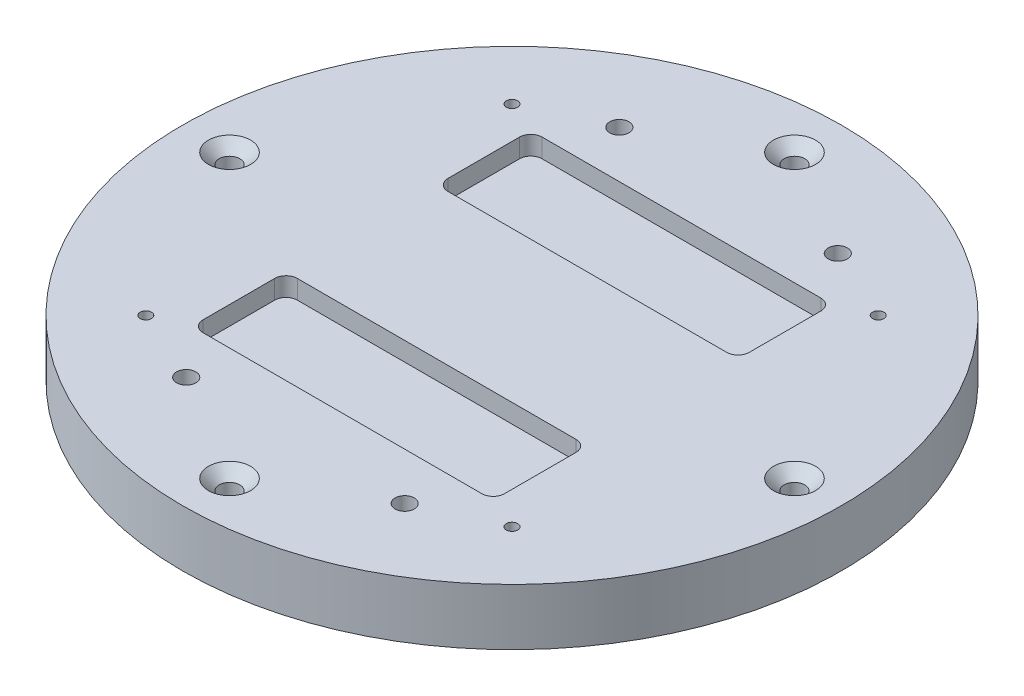
ISO-10303-21;
HEADER;
FILE_DESCRIPTION(('STEP AP214'),'2;1');
FILE_NAME('part.step','',(''),(''),'','','');
FILE_SCHEMA(('AUTOMOTIVE_DESIGN { 1 0 10303 214 1 1 1 1 }'));
ENDSEC;
DATA;
#1=APPLICATION_CONTEXT('core data for automotive mechanical design processes');
#2=APPLICATION_PROTOCOL_DEFINITION('international standard','automotive_design',2000,#1);
#3=PRODUCT_CONTEXT('',#1,'mechanical');
#4=PRODUCT('Part','Part','',(#3));
#5=PRODUCT_RELATED_PRODUCT_CATEGORY('part','',(#4));
#6=PRODUCT_DEFINITION_FORMATION('','',#4);
#7=PRODUCT_DEFINITION_CONTEXT('part definition',#1,'design');
#8=PRODUCT_DEFINITION('design','',#6,#7);
#9=PRODUCT_DEFINITION_SHAPE('','',#8);
#10=(LENGTH_UNIT() NAMED_UNIT(*) SI_UNIT(.MILLI.,.METRE.));
#11=(NAMED_UNIT(*) PLANE_ANGLE_UNIT() SI_UNIT($,.RADIAN.));
#12=(NAMED_UNIT(*) SI_UNIT($,.STERADIAN.) SOLID_ANGLE_UNIT());
#13=UNCERTAINTY_MEASURE_WITH_UNIT(LENGTH_MEASURE(1.E-05),#10,'distance_accuracy_value','');
#14=(GEOMETRIC_REPRESENTATION_CONTEXT(3) GLOBAL_UNCERTAINTY_ASSIGNED_CONTEXT((#13)) GLOBAL_UNIT_ASSIGNED_CONTEXT((#10,
#11,#12)) REPRESENTATION_CONTEXT('',''));
#15=CARTESIAN_POINT('',(0.,0.,0.));
#16=DIRECTION('',(0.,0.,1.));
#17=DIRECTION('',(1.,0.,0.));
#18=AXIS2_PLACEMENT_3D('',#15,#16,#17);
#19=CARTESIAN_POINT('',(0.,30.,0.));
#20=DIRECTION('',(0.,-1.,0.));
#21=DIRECTION('',(0.,0.,-1.));
#22=AXIS2_PLACEMENT_3D('',#19,#20,#21);
#23=CYLINDRICAL_SURFACE('',#22,175.);
#24=CARTESIAN_POINT('',(0.,30.,0.));
#25=DIRECTION('',(0.,1.,0.));
#26=DIRECTION('',(0.,0.,1.));
#27=AXIS2_PLACEMENT_3D('',#24,#25,#26);
#28=CIRCLE('',#27,175.);
#29=CARTESIAN_POINT('',(0.,30.,175.));
#30=VERTEX_POINT('',#29);
#31=EDGE_CURVE('E11',#30,#30,#28,.T.);
#32=ORIENTED_EDGE('',*,*,#31,.F.);
#33=EDGE_LOOP('',(#32));
#34=FACE_BOUND('',#33,.T.);
#35=CARTESIAN_POINT('',(0.,0.,0.));
#36=DIRECTION('',(0.,1.,0.));
#37=DIRECTION('',(0.,0.,1.));
#38=AXIS2_PLACEMENT_3D('',#35,#36,#37);
#39=CIRCLE('',#38,175.);
#40=CARTESIAN_POINT('',(0.,0.,175.));
#41=VERTEX_POINT('',#40);
#42=EDGE_CURVE('E37',#41,#41,#39,.T.);
#43=ORIENTED_EDGE('',*,*,#42,.T.);
#44=EDGE_LOOP('',(#43));
#45=FACE_BOUND('',#44,.T.);
#46=ADVANCED_FACE('F34',(#34,#45),#23,.T.);
#47=CARTESIAN_POINT('',(0.,30.,0.));
#48=DIRECTION('',(0.,1.,0.));
#49=DIRECTION('',(0.,0.,1.));
#50=AXIS2_PLACEMENT_3D('',#47,#48,#49);
#51=PLANE('',#50);
#52=CARTESIAN_POINT('',(-58.,30.,-115.));
#53=DIRECTION('',(0.,1.,0.));
#54=DIRECTION('',(0.,0.,1.));
#55=AXIS2_PLACEMENT_3D('',#52,#53,#54);
#56=CIRCLE('',#55,5.09999999999999);
#57=CARTESIAN_POINT('',(-58.,30.,-109.9));
#58=VERTEX_POINT('',#57);
#59=EDGE_CURVE('E755',#58,#58,#56,.T.);
#60=ORIENTED_EDGE('',*,*,#59,.F.);
#61=EDGE_LOOP('',(#60));
#62=FACE_BOUND('',#61,.T.);
#63=CARTESIAN_POINT('',(58.,30.,-115.));
#64=DIRECTION('',(0.,1.,0.));
#65=DIRECTION('',(0.,0.,1.));
#66=AXIS2_PLACEMENT_3D('',#63,#64,#65);
#67=CIRCLE('',#66,5.09999999999999);
#68=CARTESIAN_POINT('',(58.,30.,-109.9));
#69=VERTEX_POINT('',#68);
#70=EDGE_CURVE('E764',#69,#69,#67,.T.);
#71=ORIENTED_EDGE('',*,*,#70,.F.);
#72=EDGE_LOOP('',(#71));
#73=FACE_BOUND('',#72,.T.);
#74=CARTESIAN_POINT('',(58.,30.,115.));
#75=DIRECTION('',(0.,1.,0.));
#76=DIRECTION('',(0.,0.,1.));
#77=AXIS2_PLACEMENT_3D('',#74,#75,#76);
#78=CIRCLE('',#77,5.09999999999999);
#79=CARTESIAN_POINT('',(58.,30.,120.1));
#80=VERTEX_POINT('',#79);
#81=EDGE_CURVE('E773',#80,#80,#78,.T.);
#82=ORIENTED_EDGE('',*,*,#81,.F.);
#83=EDGE_LOOP('',(#82));
#84=FACE_BOUND('',#83,.T.);
#85=CARTESIAN_POINT('',(-58.,30.,115.));
#86=DIRECTION('',(0.,1.,0.));
#87=DIRECTION('',(0.,0.,1.));
#88=AXIS2_PLACEMENT_3D('',#85,#86,#87);
#89=CIRCLE('',#88,5.09999999999999);
#90=CARTESIAN_POINT('',(-58.,30.,120.1));
#91=VERTEX_POINT('',#90);
#92=EDGE_CURVE('E781',#91,#91,#89,.T.);
#93=ORIENTED_EDGE('',*,*,#92,.F.);
#94=EDGE_LOOP('',(#93));
#95=FACE_BOUND('',#94,.T.);
#96=CARTESIAN_POINT('',(74.,30.,-84.));
#97=DIRECTION('',(0.,1.,0.));
#98=DIRECTION('',(0.,0.,1.));
#99=AXIS2_PLACEMENT_3D('',#96,#97,#98);
#100=CIRCLE('',#99,6.00000000000001);
#101=CARTESIAN_POINT('',(80.,30.,-83.9999999999999));
#102=VERTEX_POINT('',#101);
#103=CARTESIAN_POINT('',(73.9999999999999,30.,-90.));
#104=VERTEX_POINT('',#103);
#105=EDGE_CURVE('E48',#102,#104,#100,.T.);
#106=ORIENTED_EDGE('',*,*,#105,.F.);
#107=DIRECTION('',(0.,0.,-1.));
#108=VECTOR('',#107,1.);
#109=CARTESIAN_POINT('',(80.,30.,-46.));
#110=LINE('',#109,#108);
#111=CARTESIAN_POINT('',(80.,30.,-46.));
#112=VERTEX_POINT('',#111);
#113=EDGE_CURVE('E167',#112,#102,#110,.T.);
#114=ORIENTED_EDGE('',*,*,#113,.F.);
#115=CARTESIAN_POINT('',(74.,30.,-46.));
#116=DIRECTION('',(0.,1.,0.));
#117=DIRECTION('',(0.,0.,-1.));
#118=AXIS2_PLACEMENT_3D('',#115,#116,#117);
#119=CIRCLE('',#118,6.);
#120=CARTESIAN_POINT('',(74.,30.,-40.));
#121=VERTEX_POINT('',#120);
#122=EDGE_CURVE('E170',#121,#112,#119,.T.);
#123=ORIENTED_EDGE('',*,*,#122,.F.);
#124=DIRECTION('',(1.,0.,0.));
#125=VECTOR('',#124,1.);
#126=CARTESIAN_POINT('',(-74.,30.,-40.));
#127=LINE('',#126,#125);
#128=CARTESIAN_POINT('',(-74.,30.,-40.));
#129=VERTEX_POINT('',#128);
#130=EDGE_CURVE('E201',#129,#121,#127,.T.);
#131=ORIENTED_EDGE('',*,*,#130,.F.);
#132=CARTESIAN_POINT('',(-74.,30.,-46.));
#133=DIRECTION('',(0.,1.,0.));
#134=DIRECTION('',(0.,0.,-1.));
#135=AXIS2_PLACEMENT_3D('',#132,#133,#134);
#136=CIRCLE('',#135,6.);
#137=CARTESIAN_POINT('',(-80.,30.,-46.));
#138=VERTEX_POINT('',#137);
#139=EDGE_CURVE('E198',#138,#129,#136,.T.);
#140=ORIENTED_EDGE('',*,*,#139,.F.);
#141=DIRECTION('',(0.,0.,1.));
#142=VECTOR('',#141,1.);
#143=CARTESIAN_POINT('',(-80.,30.,-46.));
#144=LINE('',#143,#142);
#145=CARTESIAN_POINT('',(-80.,30.,-83.9999999999999));
#146=VERTEX_POINT('',#145);
#147=EDGE_CURVE('E195',#146,#138,#144,.T.);
#148=ORIENTED_EDGE('',*,*,#147,.F.);
#149=CARTESIAN_POINT('',(-74.,30.,-84.));
#150=DIRECTION('',(0.,1.,0.));
#151=DIRECTION('',(0.,0.,1.));
#152=AXIS2_PLACEMENT_3D('',#149,#150,#151);
#153=CIRCLE('',#152,6.00000000000001);
#154=CARTESIAN_POINT('',(-74.,30.,-90.));
#155=VERTEX_POINT('',#154);
#156=EDGE_CURVE('E192',#155,#146,#153,.T.);
#157=ORIENTED_EDGE('',*,*,#156,.F.);
#158=DIRECTION('',(-1.,0.,0.));
#159=VECTOR('',#158,1.);
#160=CARTESIAN_POINT('',(-74.,30.,-90.));
#161=LINE('',#160,#159);
#162=EDGE_CURVE('E190',#104,#155,#161,.T.);
#163=ORIENTED_EDGE('',*,*,#162,.F.);
#164=EDGE_LOOP('',(#106,#114,#123,#131,#140,#148,#157,#163));
#165=FACE_BOUND('',#164,.T.);
#166=CARTESIAN_POINT('',(74.,30.,84.));
#167=DIRECTION('',(0.,1.,0.));
#168=DIRECTION('',(0.,0.,-1.));
#169=AXIS2_PLACEMENT_3D('',#166,#167,#168);
#170=CIRCLE('',#169,5.99999999999999);
#171=CARTESIAN_POINT('',(74.,30.,90.));
#172=VERTEX_POINT('',#171);
#173=CARTESIAN_POINT('',(80.,30.,84.));
#174=VERTEX_POINT('',#173);
#175=EDGE_CURVE('E56',#172,#174,#170,.T.);
#176=ORIENTED_EDGE('',*,*,#175,.F.);
#177=DIRECTION('',(1.,0.,0.));
#178=VECTOR('',#177,1.);
#179=CARTESIAN_POINT('',(-74.,30.,90.));
#180=LINE('',#179,#178);
#181=CARTESIAN_POINT('',(-74.,30.,90.));
#182=VERTEX_POINT('',#181);
#183=EDGE_CURVE('E223',#182,#172,#180,.T.);
#184=ORIENTED_EDGE('',*,*,#183,.F.);
#185=CARTESIAN_POINT('',(-74.,30.,84.));
#186=DIRECTION('',(0.,1.,0.));
#187=DIRECTION('',(0.,0.,-1.));
#188=AXIS2_PLACEMENT_3D('',#185,#186,#187);
#189=CIRCLE('',#188,6.00000000000001);
#190=CARTESIAN_POINT('',(-80.,30.,83.9999999999999));
#191=VERTEX_POINT('',#190);
#192=EDGE_CURVE('E261',#191,#182,#189,.T.);
#193=ORIENTED_EDGE('',*,*,#192,.F.);
#194=DIRECTION('',(0.,0.,1.));
#195=VECTOR('',#194,1.);
#196=CARTESIAN_POINT('',(-80.,30.,46.));
#197=LINE('',#196,#195);
#198=CARTESIAN_POINT('',(-80.,30.,46.));
#199=VERTEX_POINT('',#198);
#200=EDGE_CURVE('E258',#199,#191,#197,.T.);
#201=ORIENTED_EDGE('',*,*,#200,.F.);
#202=CARTESIAN_POINT('',(-74.,30.,46.));
#203=DIRECTION('',(0.,1.,0.));
#204=DIRECTION('',(0.,0.,1.));
#205=AXIS2_PLACEMENT_3D('',#202,#203,#204);
#206=CIRCLE('',#205,6.);
#207=CARTESIAN_POINT('',(-74.,30.,40.));
#208=VERTEX_POINT('',#207);
#209=EDGE_CURVE('E255',#208,#199,#206,.T.);
#210=ORIENTED_EDGE('',*,*,#209,.F.);
#211=DIRECTION('',(-1.,0.,0.));
#212=VECTOR('',#211,1.);
#213=CARTESIAN_POINT('',(-74.,30.,40.));
#214=LINE('',#213,#212);
#215=CARTESIAN_POINT('',(74.,30.,40.));
#216=VERTEX_POINT('',#215);
#217=EDGE_CURVE('E252',#216,#208,#214,.T.);
#218=ORIENTED_EDGE('',*,*,#217,.F.);
#219=CARTESIAN_POINT('',(74.,30.,46.));
#220=DIRECTION('',(0.,1.,0.));
#221=DIRECTION('',(0.,0.,1.));
#222=AXIS2_PLACEMENT_3D('',#219,#220,#221);
#223=CIRCLE('',#222,6.);
#224=CARTESIAN_POINT('',(80.,30.,46.));
#225=VERTEX_POINT('',#224);
#226=EDGE_CURVE('E249',#225,#216,#223,.T.);
#227=ORIENTED_EDGE('',*,*,#226,.F.);
#228=DIRECTION('',(0.,0.,-1.));
#229=VECTOR('',#228,1.);
#230=CARTESIAN_POINT('',(80.,30.,46.));
#231=LINE('',#230,#229);
#232=EDGE_CURVE('E246',#174,#225,#231,.T.);
#233=ORIENTED_EDGE('',*,*,#232,.F.);
#234=EDGE_LOOP('',(#176,#184,#193,#201,#210,#218,#227,#233));
#235=FACE_BOUND('',#234,.T.);
#236=CARTESIAN_POINT('',(-97.2271824131503,30.,97.2271824131503));
#237=DIRECTION('',(0.,1.,0.));
#238=DIRECTION('',(0.,0.,1.));
#239=AXIS2_PLACEMENT_3D('',#236,#237,#238);
#240=CIRCLE('',#239,2.99999999999999);
#241=CARTESIAN_POINT('',(-97.2271824131503,30.,100.22718241315));
#242=VERTEX_POINT('',#241);
#243=EDGE_CURVE('E268',#242,#242,#240,.T.);
#244=ORIENTED_EDGE('',*,*,#243,.F.);
#245=EDGE_LOOP('',(#244));
#246=FACE_BOUND('',#245,.T.);
#247=CARTESIAN_POINT('',(97.2271824131503,30.,97.2271824131503));
#248=DIRECTION('',(0.,1.,0.));
#249=DIRECTION('',(0.,0.,1.));
#250=AXIS2_PLACEMENT_3D('',#247,#248,#249);
#251=CIRCLE('',#250,2.99999999999999);
#252=CARTESIAN_POINT('',(97.2271824131503,30.,100.22718241315));
#253=VERTEX_POINT('',#252);
#254=EDGE_CURVE('E287',#253,#253,#251,.T.);
#255=ORIENTED_EDGE('',*,*,#254,.F.);
#256=EDGE_LOOP('',(#255));
#257=FACE_BOUND('',#256,.T.);
#258=CARTESIAN_POINT('',(97.2271824131503,30.,-97.2271824131503));
#259=DIRECTION('',(0.,1.,0.));
#260=DIRECTION('',(0.,0.,1.));
#261=AXIS2_PLACEMENT_3D('',#258,#259,#260);
#262=CIRCLE('',#261,2.99999999999999);
#263=CARTESIAN_POINT('',(97.2271824131503,30.,-94.2271824131503));
#264=VERTEX_POINT('',#263);
#265=EDGE_CURVE('E293',#264,#264,#262,.T.);
#266=ORIENTED_EDGE('',*,*,#265,.F.);
#267=EDGE_LOOP('',(#266));
#268=FACE_BOUND('',#267,.T.);
#269=CARTESIAN_POINT('',(-97.2271824131503,30.,-97.2271824131503));
#270=DIRECTION('',(0.,1.,0.));
#271=DIRECTION('',(0.,0.,1.));
#272=AXIS2_PLACEMENT_3D('',#269,#270,#271);
#273=CIRCLE('',#272,2.99999999999999);
#274=CARTESIAN_POINT('',(-97.2271824131503,30.,-94.2271824131503));
#275=VERTEX_POINT('',#274);
#276=EDGE_CURVE('E299',#275,#275,#273,.T.);
#277=ORIENTED_EDGE('',*,*,#276,.F.);
#278=EDGE_LOOP('',(#277));
#279=FACE_BOUND('',#278,.T.);
#280=CARTESIAN_POINT('',(-150.,30.,0.));
#281=DIRECTION('',(0.,1.,0.));
#282=DIRECTION('',(0.,0.,1.));
#283=AXIS2_PLACEMENT_3D('',#280,#281,#282);
#284=CIRCLE('',#283,11.2);
#285=CARTESIAN_POINT('',(-150.,30.,11.2));
#286=VERTEX_POINT('',#285);
#287=EDGE_CURVE('E305',#286,#286,#284,.T.);
#288=ORIENTED_EDGE('',*,*,#287,.F.);
#289=EDGE_LOOP('',(#288));
#290=FACE_BOUND('',#289,.T.);
#291=CARTESIAN_POINT('',(0.,30.,150.));
#292=DIRECTION('',(0.,1.,0.));
#293=DIRECTION('',(0.,0.,1.));
#294=AXIS2_PLACEMENT_3D('',#291,#292,#293);
#295=CIRCLE('',#294,11.2);
#296=CARTESIAN_POINT('',(0.,30.,161.2));
#297=VERTEX_POINT('',#296);
#298=EDGE_CURVE('E314',#297,#297,#295,.T.);
#299=ORIENTED_EDGE('',*,*,#298,.F.);
#300=EDGE_LOOP('',(#299));
#301=FACE_BOUND('',#300,.T.);
#302=CARTESIAN_POINT('',(150.,30.,0.));
#303=DIRECTION('',(0.,1.,0.));
#304=DIRECTION('',(0.,0.,1.));
#305=AXIS2_PLACEMENT_3D('',#302,#303,#304);
#306=CIRCLE('',#305,11.2);
#307=CARTESIAN_POINT('',(150.,30.,11.2));
#308=VERTEX_POINT('',#307);
#309=EDGE_CURVE('E323',#308,#308,#306,.T.);
#310=ORIENTED_EDGE('',*,*,#309,.F.);
#311=EDGE_LOOP('',(#310));
#312=FACE_BOUND('',#311,.T.);
#313=CARTESIAN_POINT('',(0.,30.,-150.));
#314=DIRECTION('',(0.,1.,0.));
#315=DIRECTION('',(0.,0.,1.));
#316=AXIS2_PLACEMENT_3D('',#313,#314,#315);
#317=CIRCLE('',#316,11.2);
#318=CARTESIAN_POINT('',(0.,30.,-138.8));
#319=VERTEX_POINT('',#318);
#320=EDGE_CURVE('E332',#319,#319,#317,.T.);
#321=ORIENTED_EDGE('',*,*,#320,.F.);
#322=EDGE_LOOP('',(#321));
#323=FACE_BOUND('',#322,.T.);
#324=ORIENTED_EDGE('',*,*,#31,.T.);
#325=EDGE_LOOP('',(#324));
#326=FACE_BOUND('',#325,.T.);
#327=ADVANCED_FACE('F349',(#62,#73,#84,#95,#165,#235,#246,#257,#268,#279,#290,#301,#312,#323,
#326),#51,.T.);
#328=CARTESIAN_POINT('',(0.,0.,0.));
#329=DIRECTION('',(0.,1.,0.));
#330=DIRECTION('',(0.,0.,1.));
#331=AXIS2_PLACEMENT_3D('',#328,#329,#330);
#332=PLANE('',#331);
#333=CARTESIAN_POINT('',(-58.,0.,-115.));
#334=DIRECTION('',(0.,1.,0.));
#335=DIRECTION('',(0.,0.,1.));
#336=AXIS2_PLACEMENT_3D('',#333,#334,#335);
#337=CIRCLE('',#336,12.5);
#338=CARTESIAN_POINT('',(-58.,0.,-102.5));
#339=VERTEX_POINT('',#338);
#340=EDGE_CURVE('E756',#339,#339,#337,.T.);
#341=ORIENTED_EDGE('',*,*,#340,.T.);
#342=EDGE_LOOP('',(#341));
#343=FACE_BOUND('',#342,.T.);
#344=CARTESIAN_POINT('',(58.,0.,-115.));
#345=DIRECTION('',(0.,1.,0.));
#346=DIRECTION('',(0.,0.,1.));
#347=AXIS2_PLACEMENT_3D('',#344,#345,#346);
#348=CIRCLE('',#347,12.5);
#349=CARTESIAN_POINT('',(58.,0.,-102.5));
#350=VERTEX_POINT('',#349);
#351=EDGE_CURVE('E758',#350,#350,#348,.T.);
#352=ORIENTED_EDGE('',*,*,#351,.T.);
#353=EDGE_LOOP('',(#352));
#354=FACE_BOUND('',#353,.T.);
#355=CARTESIAN_POINT('',(58.,0.,115.));
#356=DIRECTION('',(0.,1.,0.));
#357=DIRECTION('',(0.,0.,1.));
#358=AXIS2_PLACEMENT_3D('',#355,#356,#357);
#359=CIRCLE('',#358,12.5);
#360=CARTESIAN_POINT('',(58.,0.,127.5));
#361=VERTEX_POINT('',#360);
#362=EDGE_CURVE('E770',#361,#361,#359,.T.);
#363=ORIENTED_EDGE('',*,*,#362,.T.);
#364=EDGE_LOOP('',(#363));
#365=FACE_BOUND('',#364,.T.);
#366=CARTESIAN_POINT('',(-58.,0.,115.));
#367=DIRECTION('',(0.,1.,0.));
#368=DIRECTION('',(0.,0.,1.));
#369=AXIS2_PLACEMENT_3D('',#366,#367,#368);
#370=CIRCLE('',#369,12.5);
#371=CARTESIAN_POINT('',(-58.,0.,127.5));
#372=VERTEX_POINT('',#371);
#373=EDGE_CURVE('E779',#372,#372,#370,.T.);
#374=ORIENTED_EDGE('',*,*,#373,.T.);
#375=EDGE_LOOP('',(#374));
#376=FACE_BOUND('',#375,.T.);
#377=CARTESIAN_POINT('',(-97.2271824131503,0.,97.2271824131503));
#378=DIRECTION('',(0.,1.,0.));
#379=DIRECTION('',(0.,0.,1.));
#380=AXIS2_PLACEMENT_3D('',#377,#378,#379);
#381=CIRCLE('',#380,2.99999999999999);
#382=CARTESIAN_POINT('',(-97.2271824131503,0.,100.22718241315));
#383=VERTEX_POINT('',#382);
#384=EDGE_CURVE('E284',#383,#383,#381,.T.);
#385=ORIENTED_EDGE('',*,*,#384,.T.);
#386=EDGE_LOOP('',(#385));
#387=FACE_BOUND('',#386,.T.);
#388=CARTESIAN_POINT('',(97.2271824131503,0.,97.2271824131503));
#389=DIRECTION('',(0.,1.,0.));
#390=DIRECTION('',(0.,0.,1.));
#391=AXIS2_PLACEMENT_3D('',#388,#389,#390);
#392=CIRCLE('',#391,2.99999999999999);
#393=CARTESIAN_POINT('',(97.2271824131503,0.,100.22718241315));
#394=VERTEX_POINT('',#393);
#395=EDGE_CURVE('E290',#394,#394,#392,.T.);
#396=ORIENTED_EDGE('',*,*,#395,.T.);
#397=EDGE_LOOP('',(#396));
#398=FACE_BOUND('',#397,.T.);
#399=CARTESIAN_POINT('',(97.2271824131503,0.,-97.2271824131503));
#400=DIRECTION('',(0.,1.,0.));
#401=DIRECTION('',(0.,0.,1.));
#402=AXIS2_PLACEMENT_3D('',#399,#400,#401);
#403=CIRCLE('',#402,2.99999999999999);
#404=CARTESIAN_POINT('',(97.2271824131503,0.,-94.2271824131503));
#405=VERTEX_POINT('',#404);
#406=EDGE_CURVE('E296',#405,#405,#403,.T.);
#407=ORIENTED_EDGE('',*,*,#406,.T.);
#408=EDGE_LOOP('',(#407));
#409=FACE_BOUND('',#408,.T.);
#410=CARTESIAN_POINT('',(-97.2271824131503,0.,-97.2271824131503));
#411=DIRECTION('',(0.,1.,0.));
#412=DIRECTION('',(0.,0.,1.));
#413=AXIS2_PLACEMENT_3D('',#410,#411,#412);
#414=CIRCLE('',#413,2.99999999999999);
#415=CARTESIAN_POINT('',(-97.2271824131503,0.,-94.2271824131503));
#416=VERTEX_POINT('',#415);
#417=EDGE_CURVE('E302',#416,#416,#414,.T.);
#418=ORIENTED_EDGE('',*,*,#417,.T.);
#419=EDGE_LOOP('',(#418));
#420=FACE_BOUND('',#419,.T.);
#421=CARTESIAN_POINT('',(-150.,0.,0.));
#422=DIRECTION('',(0.,1.,0.));
#423=DIRECTION('',(0.,0.,1.));
#424=AXIS2_PLACEMENT_3D('',#421,#422,#423);
#425=CIRCLE('',#424,5.50000000000001);
#426=CARTESIAN_POINT('',(-150.,0.,5.50000000000003));
#427=VERTEX_POINT('',#426);
#428=EDGE_CURVE('E311',#427,#427,#425,.T.);
#429=ORIENTED_EDGE('',*,*,#428,.T.);
#430=EDGE_LOOP('',(#429));
#431=FACE_BOUND('',#430,.T.);
#432=CARTESIAN_POINT('',(0.,0.,150.));
#433=DIRECTION('',(0.,1.,0.));
#434=DIRECTION('',(0.,0.,1.));
#435=AXIS2_PLACEMENT_3D('',#432,#433,#434);
#436=CIRCLE('',#435,5.49999999999999);
#437=CARTESIAN_POINT('',(0.,0.,155.5));
#438=VERTEX_POINT('',#437);
#439=EDGE_CURVE('E320',#438,#438,#436,.T.);
#440=ORIENTED_EDGE('',*,*,#439,.T.);
#441=EDGE_LOOP('',(#440));
#442=FACE_BOUND('',#441,.T.);
#443=CARTESIAN_POINT('',(150.,0.,0.));
#444=DIRECTION('',(0.,1.,0.));
#445=DIRECTION('',(0.,0.,1.));
#446=AXIS2_PLACEMENT_3D('',#443,#444,#445);
#447=CIRCLE('',#446,5.50000000000001);
#448=CARTESIAN_POINT('',(150.,0.,5.5));
#449=VERTEX_POINT('',#448);
#450=EDGE_CURVE('E329',#449,#449,#447,.T.);
#451=ORIENTED_EDGE('',*,*,#450,.T.);
#452=EDGE_LOOP('',(#451));
#453=FACE_BOUND('',#452,.T.);
#454=CARTESIAN_POINT('',(0.,0.,-150.));
#455=DIRECTION('',(0.,1.,0.));
#456=DIRECTION('',(0.,0.,1.));
#457=AXIS2_PLACEMENT_3D('',#454,#455,#456);
#458=CIRCLE('',#457,5.49999999999999);
#459=CARTESIAN_POINT('',(0.,0.,-144.5));
#460=VERTEX_POINT('',#459);
#461=EDGE_CURVE('E338',#460,#460,#458,.T.);
#462=ORIENTED_EDGE('',*,*,#461,.T.);
#463=EDGE_LOOP('',(#462));
#464=FACE_BOUND('',#463,.T.);
#465=ORIENTED_EDGE('',*,*,#42,.F.);
#466=EDGE_LOOP('',(#465));
#467=FACE_BOUND('',#466,.T.);
#468=ADVANCED_FACE('F346',(#343,#354,#365,#376,#387,#398,#409,#420,#431,#442,#453,#464,#467),
#332,.F.);
#469=CARTESIAN_POINT('',(0.,30.,-150.));
#470=DIRECTION('',(0.,1.,0.));
#471=DIRECTION('',(0.,0.,1.));
#472=AXIS2_PLACEMENT_3D('',#469,#470,#471);
#473=CYLINDRICAL_SURFACE('',#472,5.49999999999999);
#474=ORIENTED_EDGE('',*,*,#461,.F.);
#475=EDGE_LOOP('',(#474));
#476=FACE_BOUND('',#475,.T.);
#477=CARTESIAN_POINT('',(0.,24.3,-150.));
#478=DIRECTION('',(0.,1.,0.));
#479=DIRECTION('',(0.,0.,1.));
#480=AXIS2_PLACEMENT_3D('',#477,#478,#479);
#481=CIRCLE('',#480,5.5);
#482=CARTESIAN_POINT('',(0.,24.3,-144.5));
#483=VERTEX_POINT('',#482);
#484=EDGE_CURVE('E335',#483,#483,#481,.T.);
#485=ORIENTED_EDGE('',*,*,#484,.T.);
#486=EDGE_LOOP('',(#485));
#487=FACE_BOUND('',#486,.T.);
#488=ADVANCED_FACE('F348',(#476,#487),#473,.F.);
#489=CARTESIAN_POINT('',(0.,30.,-150.));
#490=DIRECTION('',(0.,1.,0.));
#491=DIRECTION('',(0.,0.,1.));
#492=AXIS2_PLACEMENT_3D('',#489,#490,#491);
#493=CONICAL_SURFACE('',#492,11.2,0.785398163397449);
#494=ORIENTED_EDGE('',*,*,#484,.F.);
#495=EDGE_LOOP('',(#494));
#496=FACE_BOUND('',#495,.T.);
#497=ORIENTED_EDGE('',*,*,#320,.T.);
#498=EDGE_LOOP('',(#497));
#499=FACE_BOUND('',#498,.T.);
#500=ADVANCED_FACE('F356',(#496,#499),#493,.F.);
#501=CARTESIAN_POINT('',(150.,30.,0.));
#502=DIRECTION('',(0.,1.,0.));
#503=DIRECTION('',(0.,0.,1.));
#504=AXIS2_PLACEMENT_3D('',#501,#502,#503);
#505=CYLINDRICAL_SURFACE('',#504,5.50000000000001);
#506=ORIENTED_EDGE('',*,*,#450,.F.);
#507=EDGE_LOOP('',(#506));
#508=FACE_BOUND('',#507,.T.);
#509=CARTESIAN_POINT('',(150.,24.3,0.));
#510=DIRECTION('',(0.,1.,0.));
#511=DIRECTION('',(0.,0.,1.));
#512=AXIS2_PLACEMENT_3D('',#509,#510,#511);
#513=CIRCLE('',#512,5.50000000000001);
#514=CARTESIAN_POINT('',(150.,24.3,5.5));
#515=VERTEX_POINT('',#514);
#516=EDGE_CURVE('E326',#515,#515,#513,.T.);
#517=ORIENTED_EDGE('',*,*,#516,.T.);
#518=EDGE_LOOP('',(#517));
#519=FACE_BOUND('',#518,.T.);
#520=ADVANCED_FACE('F391',(#508,#519),#505,.F.);
#521=CARTESIAN_POINT('',(150.,30.,0.));
#522=DIRECTION('',(0.,1.,0.));
#523=DIRECTION('',(0.,0.,1.));
#524=AXIS2_PLACEMENT_3D('',#521,#522,#523);
#525=CONICAL_SURFACE('',#524,11.2,0.785398163397447);
#526=ORIENTED_EDGE('',*,*,#516,.F.);
#527=EDGE_LOOP('',(#526));
#528=FACE_BOUND('',#527,.T.);
#529=ORIENTED_EDGE('',*,*,#309,.T.);
#530=EDGE_LOOP('',(#529));
#531=FACE_BOUND('',#530,.T.);
#532=ADVANCED_FACE('F399',(#528,#531),#525,.F.);
#533=CARTESIAN_POINT('',(0.,30.,150.));
#534=DIRECTION('',(0.,1.,0.));
#535=DIRECTION('',(0.,0.,1.));
#536=AXIS2_PLACEMENT_3D('',#533,#534,#535);
#537=CYLINDRICAL_SURFACE('',#536,5.49999999999999);
#538=ORIENTED_EDGE('',*,*,#439,.F.);
#539=EDGE_LOOP('',(#538));
#540=FACE_BOUND('',#539,.T.);
#541=CARTESIAN_POINT('',(0.,24.3,150.));
#542=DIRECTION('',(0.,1.,0.));
#543=DIRECTION('',(0.,0.,1.));
#544=AXIS2_PLACEMENT_3D('',#541,#542,#543);
#545=CIRCLE('',#544,5.5);
#546=CARTESIAN_POINT('',(0.,24.3,155.5));
#547=VERTEX_POINT('',#546);
#548=EDGE_CURVE('E317',#547,#547,#545,.T.);
#549=ORIENTED_EDGE('',*,*,#548,.T.);
#550=EDGE_LOOP('',(#549));
#551=FACE_BOUND('',#550,.T.);
#552=ADVANCED_FACE('F407',(#540,#551),#537,.F.);
#553=CARTESIAN_POINT('',(0.,30.,150.));
#554=DIRECTION('',(0.,1.,0.));
#555=DIRECTION('',(0.,0.,1.));
#556=AXIS2_PLACEMENT_3D('',#553,#554,#555);
#557=CONICAL_SURFACE('',#556,11.2,0.785398163397449);
#558=ORIENTED_EDGE('',*,*,#548,.F.);
#559=EDGE_LOOP('',(#558));
#560=FACE_BOUND('',#559,.T.);
#561=ORIENTED_EDGE('',*,*,#298,.T.);
#562=EDGE_LOOP('',(#561));
#563=FACE_BOUND('',#562,.T.);
#564=ADVANCED_FACE('F415',(#560,#563),#557,.F.);
#565=CARTESIAN_POINT('',(-150.,30.,0.));
#566=DIRECTION('',(0.,1.,0.));
#567=DIRECTION('',(0.,0.,1.));
#568=AXIS2_PLACEMENT_3D('',#565,#566,#567);
#569=CYLINDRICAL_SURFACE('',#568,5.50000000000001);
#570=ORIENTED_EDGE('',*,*,#428,.F.);
#571=EDGE_LOOP('',(#570));
#572=FACE_BOUND('',#571,.T.);
#573=CARTESIAN_POINT('',(-150.,24.3,0.));
#574=DIRECTION('',(0.,1.,0.));
#575=DIRECTION('',(0.,0.,1.));
#576=AXIS2_PLACEMENT_3D('',#573,#574,#575);
#577=CIRCLE('',#576,5.50000000000001);
#578=CARTESIAN_POINT('',(-150.,24.3,5.50000000000003));
#579=VERTEX_POINT('',#578);
#580=EDGE_CURVE('E308',#579,#579,#577,.T.);
#581=ORIENTED_EDGE('',*,*,#580,.T.);
#582=EDGE_LOOP('',(#581));
#583=FACE_BOUND('',#582,.T.);
#584=ADVANCED_FACE('F423',(#572,#583),#569,.F.);
#585=CARTESIAN_POINT('',(-150.,30.,0.));
#586=DIRECTION('',(0.,1.,0.));
#587=DIRECTION('',(0.,0.,1.));
#588=AXIS2_PLACEMENT_3D('',#585,#586,#587);
#589=CONICAL_SURFACE('',#588,11.2,0.785398163397447);
#590=ORIENTED_EDGE('',*,*,#580,.F.);
#591=EDGE_LOOP('',(#590));
#592=FACE_BOUND('',#591,.T.);
#593=ORIENTED_EDGE('',*,*,#287,.T.);
#594=EDGE_LOOP('',(#593));
#595=FACE_BOUND('',#594,.T.);
#596=ADVANCED_FACE('F431',(#592,#595),#589,.F.);
#597=CARTESIAN_POINT('',(-97.2271824131503,30.,-97.2271824131503));
#598=DIRECTION('',(0.,1.,0.));
#599=DIRECTION('',(0.,0.,1.));
#600=AXIS2_PLACEMENT_3D('',#597,#598,#599);
#601=CYLINDRICAL_SURFACE('',#600,2.99999999999999);
#602=ORIENTED_EDGE('',*,*,#417,.F.);
#603=EDGE_LOOP('',(#602));
#604=FACE_BOUND('',#603,.T.);
#605=ORIENTED_EDGE('',*,*,#276,.T.);
#606=EDGE_LOOP('',(#605));
#607=FACE_BOUND('',#606,.T.);
#608=ADVANCED_FACE('F439',(#604,#607),#601,.F.);
#609=CARTESIAN_POINT('',(97.2271824131503,30.,-97.2271824131503));
#610=DIRECTION('',(0.,1.,0.));
#611=DIRECTION('',(0.,0.,1.));
#612=AXIS2_PLACEMENT_3D('',#609,#610,#611);
#613=CYLINDRICAL_SURFACE('',#612,2.99999999999999);
#614=ORIENTED_EDGE('',*,*,#406,.F.);
#615=EDGE_LOOP('',(#614));
#616=FACE_BOUND('',#615,.T.);
#617=ORIENTED_EDGE('',*,*,#265,.T.);
#618=EDGE_LOOP('',(#617));
#619=FACE_BOUND('',#618,.T.);
#620=ADVANCED_FACE('F447',(#616,#619),#613,.F.);
#621=CARTESIAN_POINT('',(97.2271824131503,30.,97.2271824131503));
#622=DIRECTION('',(0.,1.,0.));
#623=DIRECTION('',(0.,0.,1.));
#624=AXIS2_PLACEMENT_3D('',#621,#622,#623);
#625=CYLINDRICAL_SURFACE('',#624,2.99999999999999);
#626=ORIENTED_EDGE('',*,*,#395,.F.);
#627=EDGE_LOOP('',(#626));
#628=FACE_BOUND('',#627,.T.);
#629=ORIENTED_EDGE('',*,*,#254,.T.);
#630=EDGE_LOOP('',(#629));
#631=FACE_BOUND('',#630,.T.);
#632=ADVANCED_FACE('F455',(#628,#631),#625,.F.);
#633=CARTESIAN_POINT('',(-97.2271824131503,30.,97.2271824131503));
#634=DIRECTION('',(0.,1.,0.));
#635=DIRECTION('',(0.,0.,1.));
#636=AXIS2_PLACEMENT_3D('',#633,#634,#635);
#637=CYLINDRICAL_SURFACE('',#636,2.99999999999999);
#638=ORIENTED_EDGE('',*,*,#384,.F.);
#639=EDGE_LOOP('',(#638));
#640=FACE_BOUND('',#639,.T.);
#641=ORIENTED_EDGE('',*,*,#243,.T.);
#642=EDGE_LOOP('',(#641));
#643=FACE_BOUND('',#642,.T.);
#644=ADVANCED_FACE('F463',(#640,#643),#637,.F.);
#645=CARTESIAN_POINT('',(74.,20.,84.));
#646=DIRECTION('',(0.,1.,0.));
#647=DIRECTION('',(0.,0.,1.));
#648=AXIS2_PLACEMENT_3D('',#645,#646,#647);
#649=CYLINDRICAL_SURFACE('',#648,5.99999999999999);
#650=ORIENTED_EDGE('',*,*,#175,.T.);
#651=DIRECTION('',(0.,1.,0.));
#652=VECTOR('',#651,1.);
#653=CARTESIAN_POINT('',(80.,20.,84.));
#654=LINE('',#653,#652);
#655=CARTESIAN_POINT('',(80.,20.,84.));
#656=VERTEX_POINT('',#655);
#657=EDGE_CURVE('E244',#656,#174,#654,.T.);
#658=ORIENTED_EDGE('',*,*,#657,.F.);
#659=CARTESIAN_POINT('',(74.,20.,84.));
#660=DIRECTION('',(0.,1.,0.));
#661=DIRECTION('',(0.,0.,-1.));
#662=AXIS2_PLACEMENT_3D('',#659,#660,#661);
#663=CIRCLE('',#662,5.99999999999999);
#664=CARTESIAN_POINT('',(74.,20.,90.));
#665=VERTEX_POINT('',#664);
#666=EDGE_CURVE('E219',#665,#656,#663,.T.);
#667=ORIENTED_EDGE('',*,*,#666,.F.);
#668=DIRECTION('',(0.,1.,0.));
#669=VECTOR('',#668,1.);
#670=CARTESIAN_POINT('',(74.,20.,90.));
#671=LINE('',#670,#669);
#672=EDGE_CURVE('E266',#665,#172,#671,.T.);
#673=ORIENTED_EDGE('',*,*,#672,.T.);
#674=EDGE_LOOP('',(#650,#658,#667,#673));
#675=FACE_BOUND('',#674,.T.);
#676=ADVANCED_FACE('F471',(#675),#649,.F.);
#677=CARTESIAN_POINT('',(-74.,20.,90.));
#678=DIRECTION('',(0.,0.,1.));
#679=DIRECTION('',(1.,0.,0.));
#680=AXIS2_PLACEMENT_3D('',#677,#678,#679);
#681=PLANE('',#680);
#682=ORIENTED_EDGE('',*,*,#183,.T.);
#683=ORIENTED_EDGE('',*,*,#672,.F.);
#684=DIRECTION('',(1.,0.,0.));
#685=VECTOR('',#684,1.);
#686=CARTESIAN_POINT('',(-74.,20.,90.));
#687=LINE('',#686,#685);
#688=CARTESIAN_POINT('',(-74.,20.,90.));
#689=VERTEX_POINT('',#688);
#690=EDGE_CURVE('E241',#689,#665,#687,.T.);
#691=ORIENTED_EDGE('',*,*,#690,.F.);
#692=DIRECTION('',(0.,1.,0.));
#693=VECTOR('',#692,1.);
#694=CARTESIAN_POINT('',(-74.,20.,90.));
#695=LINE('',#694,#693);
#696=EDGE_CURVE('E269',#689,#182,#695,.T.);
#697=ORIENTED_EDGE('',*,*,#696,.T.);
#698=EDGE_LOOP('',(#682,#683,#691,#697));
#699=FACE_BOUND('',#698,.T.);
#700=ADVANCED_FACE('F479',(#699),#681,.F.);
#701=CARTESIAN_POINT('',(-74.,20.,84.));
#702=DIRECTION('',(0.,1.,0.));
#703=DIRECTION('',(0.,0.,1.));
#704=AXIS2_PLACEMENT_3D('',#701,#702,#703);
#705=CYLINDRICAL_SURFACE('',#704,6.00000000000001);
#706=ORIENTED_EDGE('',*,*,#192,.T.);
#707=ORIENTED_EDGE('',*,*,#696,.F.);
#708=CARTESIAN_POINT('',(-74.,20.,84.));
#709=DIRECTION('',(0.,1.,0.));
#710=DIRECTION('',(0.,0.,-1.));
#711=AXIS2_PLACEMENT_3D('',#708,#709,#710);
#712=CIRCLE('',#711,6.00000000000001);
#713=CARTESIAN_POINT('',(-80.,20.,83.9999999999999));
#714=VERTEX_POINT('',#713);
#715=EDGE_CURVE('E238',#714,#689,#712,.T.);
#716=ORIENTED_EDGE('',*,*,#715,.F.);
#717=DIRECTION('',(0.,1.,0.));
#718=VECTOR('',#717,1.);
#719=CARTESIAN_POINT('',(-80.,20.,83.9999999999999));
#720=LINE('',#719,#718);
#721=EDGE_CURVE('E271',#714,#191,#720,.T.);
#722=ORIENTED_EDGE('',*,*,#721,.T.);
#723=EDGE_LOOP('',(#706,#707,#716,#722));
#724=FACE_BOUND('',#723,.T.);
#725=ADVANCED_FACE('F486',(#724),#705,.F.);
#726=CARTESIAN_POINT('',(-80.,20.,46.));
#727=DIRECTION('',(-1.,0.,0.));
#728=DIRECTION('',(0.,0.,1.));
#729=AXIS2_PLACEMENT_3D('',#726,#727,#728);
#730=PLANE('',#729);
#731=ORIENTED_EDGE('',*,*,#200,.T.);
#732=ORIENTED_EDGE('',*,*,#721,.F.);
#733=DIRECTION('',(0.,0.,1.));
#734=VECTOR('',#733,1.);
#735=CARTESIAN_POINT('',(-80.,20.,46.));
#736=LINE('',#735,#734);
#737=CARTESIAN_POINT('',(-80.,20.,46.));
#738=VERTEX_POINT('',#737);
#739=EDGE_CURVE('E235',#738,#714,#736,.T.);
#740=ORIENTED_EDGE('',*,*,#739,.F.);
#741=DIRECTION('',(0.,1.,0.));
#742=VECTOR('',#741,1.);
#743=CARTESIAN_POINT('',(-80.,20.,46.));
#744=LINE('',#743,#742);
#745=EDGE_CURVE('E273',#738,#199,#744,.T.);
#746=ORIENTED_EDGE('',*,*,#745,.T.);
#747=EDGE_LOOP('',(#731,#732,#740,#746));
#748=FACE_BOUND('',#747,.T.);
#749=ADVANCED_FACE('F494',(#748),#730,.F.);
#750=CARTESIAN_POINT('',(-74.,20.,46.));
#751=DIRECTION('',(0.,1.,0.));
#752=DIRECTION('',(0.,0.,1.));
#753=AXIS2_PLACEMENT_3D('',#750,#751,#752);
#754=CYLINDRICAL_SURFACE('',#753,6.);
#755=ORIENTED_EDGE('',*,*,#209,.T.);
#756=ORIENTED_EDGE('',*,*,#745,.F.);
#757=CARTESIAN_POINT('',(-74.,20.,46.));
#758=DIRECTION('',(0.,1.,0.));
#759=DIRECTION('',(0.,0.,1.));
#760=AXIS2_PLACEMENT_3D('',#757,#758,#759);
#761=CIRCLE('',#760,6.);
#762=CARTESIAN_POINT('',(-74.,20.,40.));
#763=VERTEX_POINT('',#762);
#764=EDGE_CURVE('E232',#763,#738,#761,.T.);
#765=ORIENTED_EDGE('',*,*,#764,.F.);
#766=DIRECTION('',(0.,1.,0.));
#767=VECTOR('',#766,1.);
#768=CARTESIAN_POINT('',(-74.,20.,40.));
#769=LINE('',#768,#767);
#770=EDGE_CURVE('E275',#763,#208,#769,.T.);
#771=ORIENTED_EDGE('',*,*,#770,.T.);
#772=EDGE_LOOP('',(#755,#756,#765,#771));
#773=FACE_BOUND('',#772,.T.);
#774=ADVANCED_FACE('F502',(#773),#754,.F.);
#775=CARTESIAN_POINT('',(-74.,20.,40.));
#776=DIRECTION('',(0.,0.,-1.));
#777=DIRECTION('',(-1.,0.,0.));
#778=AXIS2_PLACEMENT_3D('',#775,#776,#777);
#779=PLANE('',#778);
#780=ORIENTED_EDGE('',*,*,#217,.T.);
#781=ORIENTED_EDGE('',*,*,#770,.F.);
#782=DIRECTION('',(-1.,0.,0.));
#783=VECTOR('',#782,1.);
#784=CARTESIAN_POINT('',(-74.,20.,40.));
#785=LINE('',#784,#783);
#786=CARTESIAN_POINT('',(74.,20.,40.));
#787=VERTEX_POINT('',#786);
#788=EDGE_CURVE('E229',#787,#763,#785,.T.);
#789=ORIENTED_EDGE('',*,*,#788,.F.);
#790=DIRECTION('',(0.,1.,0.));
#791=VECTOR('',#790,1.);
#792=CARTESIAN_POINT('',(74.,20.,40.));
#793=LINE('',#792,#791);
#794=EDGE_CURVE('E277',#787,#216,#793,.T.);
#795=ORIENTED_EDGE('',*,*,#794,.T.);
#796=EDGE_LOOP('',(#780,#781,#789,#795));
#797=FACE_BOUND('',#796,.T.);
#798=ADVANCED_FACE('F510',(#797),#779,.F.);
#799=CARTESIAN_POINT('',(74.,20.,46.));
#800=DIRECTION('',(0.,1.,0.));
#801=DIRECTION('',(0.,0.,1.));
#802=AXIS2_PLACEMENT_3D('',#799,#800,#801);
#803=CYLINDRICAL_SURFACE('',#802,6.);
#804=ORIENTED_EDGE('',*,*,#226,.T.);
#805=ORIENTED_EDGE('',*,*,#794,.F.);
#806=CARTESIAN_POINT('',(74.,20.,46.));
#807=DIRECTION('',(0.,1.,0.));
#808=DIRECTION('',(0.,0.,1.));
#809=AXIS2_PLACEMENT_3D('',#806,#807,#808);
#810=CIRCLE('',#809,6.);
#811=CARTESIAN_POINT('',(80.,20.,46.));
#812=VERTEX_POINT('',#811);
#813=EDGE_CURVE('E226',#812,#787,#810,.T.);
#814=ORIENTED_EDGE('',*,*,#813,.F.);
#815=DIRECTION('',(0.,1.,0.));
#816=VECTOR('',#815,1.);
#817=CARTESIAN_POINT('',(80.,20.,46.));
#818=LINE('',#817,#816);
#819=EDGE_CURVE('E279',#812,#225,#818,.T.);
#820=ORIENTED_EDGE('',*,*,#819,.T.);
#821=EDGE_LOOP('',(#804,#805,#814,#820));
#822=FACE_BOUND('',#821,.T.);
#823=ADVANCED_FACE('F518',(#822),#803,.F.);
#824=CARTESIAN_POINT('',(80.,20.,46.));
#825=DIRECTION('',(1.,0.,0.));
#826=DIRECTION('',(0.,0.,-1.));
#827=AXIS2_PLACEMENT_3D('',#824,#825,#826);
#828=PLANE('',#827);
#829=ORIENTED_EDGE('',*,*,#232,.T.);
#830=ORIENTED_EDGE('',*,*,#819,.F.);
#831=DIRECTION('',(0.,0.,-1.));
#832=VECTOR('',#831,1.);
#833=CARTESIAN_POINT('',(80.,20.,46.));
#834=LINE('',#833,#832);
#835=EDGE_CURVE('E222',#656,#812,#834,.T.);
#836=ORIENTED_EDGE('',*,*,#835,.F.);
#837=ORIENTED_EDGE('',*,*,#657,.T.);
#838=EDGE_LOOP('',(#829,#830,#836,#837));
#839=FACE_BOUND('',#838,.T.);
#840=ADVANCED_FACE('F526',(#839),#828,.F.);
#841=CARTESIAN_POINT('',(74.,20.,84.));
#842=DIRECTION('',(0.,-1.,0.));
#843=DIRECTION('',(0.,0.,-1.));
#844=AXIS2_PLACEMENT_3D('',#841,#842,#843);
#845=PLANE('',#844);
#846=ORIENTED_EDGE('',*,*,#666,.T.);
#847=ORIENTED_EDGE('',*,*,#835,.T.);
#848=ORIENTED_EDGE('',*,*,#813,.T.);
#849=ORIENTED_EDGE('',*,*,#788,.T.);
#850=ORIENTED_EDGE('',*,*,#764,.T.);
#851=ORIENTED_EDGE('',*,*,#739,.T.);
#852=ORIENTED_EDGE('',*,*,#715,.T.);
#853=ORIENTED_EDGE('',*,*,#690,.T.);
#854=EDGE_LOOP('',(#846,#847,#848,#849,#850,#851,#852,#853));
#855=FACE_BOUND('',#854,.T.);
#856=ADVANCED_FACE('F534',(#855),#845,.F.);
#857=CARTESIAN_POINT('',(74.,20.,-84.));
#858=DIRECTION('',(0.,1.,0.));
#859=DIRECTION('',(0.,0.,1.));
#860=AXIS2_PLACEMENT_3D('',#857,#858,#859);
#861=CYLINDRICAL_SURFACE('',#860,6.00000000000001);
#862=ORIENTED_EDGE('',*,*,#105,.T.);
#863=DIRECTION('',(0.,1.,0.));
#864=VECTOR('',#863,1.);
#865=CARTESIAN_POINT('',(73.9999999999999,20.,-90.));
#866=LINE('',#865,#864);
#867=CARTESIAN_POINT('',(73.9999999999999,20.,-90.));
#868=VERTEX_POINT('',#867);
#869=EDGE_CURVE('E144',#868,#104,#866,.T.);
#870=ORIENTED_EDGE('',*,*,#869,.F.);
#871=CARTESIAN_POINT('',(74.,20.,-84.));
#872=DIRECTION('',(0.,1.,0.));
#873=DIRECTION('',(0.,0.,1.));
#874=AXIS2_PLACEMENT_3D('',#871,#872,#873);
#875=CIRCLE('',#874,6.00000000000001);
#876=CARTESIAN_POINT('',(80.,20.,-83.9999999999999));
#877=VERTEX_POINT('',#876);
#878=EDGE_CURVE('E148',#877,#868,#875,.T.);
#879=ORIENTED_EDGE('',*,*,#878,.F.);
#880=DIRECTION('',(0.,1.,0.));
#881=VECTOR('',#880,1.);
#882=CARTESIAN_POINT('',(80.,20.,-83.9999999999999));
#883=LINE('',#882,#881);
#884=EDGE_CURVE('E206',#877,#102,#883,.T.);
#885=ORIENTED_EDGE('',*,*,#884,.T.);
#886=EDGE_LOOP('',(#862,#870,#879,#885));
#887=FACE_BOUND('',#886,.T.);
#888=ADVANCED_FACE('F146',(#887),#861,.F.);
#889=CARTESIAN_POINT('',(80.,20.,-46.));
#890=DIRECTION('',(1.,0.,0.));
#891=DIRECTION('',(0.,0.,-1.));
#892=AXIS2_PLACEMENT_3D('',#889,#890,#891);
#893=PLANE('',#892);
#894=ORIENTED_EDGE('',*,*,#113,.T.);
#895=ORIENTED_EDGE('',*,*,#884,.F.);
#896=DIRECTION('',(0.,0.,-1.));
#897=VECTOR('',#896,1.);
#898=CARTESIAN_POINT('',(80.,20.,-46.));
#899=LINE('',#898,#897);
#900=CARTESIAN_POINT('',(80.,20.,-46.));
#901=VERTEX_POINT('',#900);
#902=EDGE_CURVE('E154',#901,#877,#899,.T.);
#903=ORIENTED_EDGE('',*,*,#902,.F.);
#904=DIRECTION('',(0.,1.,0.));
#905=VECTOR('',#904,1.);
#906=CARTESIAN_POINT('',(80.,20.,-46.));
#907=LINE('',#906,#905);
#908=EDGE_CURVE('E208',#901,#112,#907,.T.);
#909=ORIENTED_EDGE('',*,*,#908,.T.);
#910=EDGE_LOOP('',(#894,#895,#903,#909));
#911=FACE_BOUND('',#910,.T.);
#912=ADVANCED_FACE('F549',(#911),#893,.F.);
#913=CARTESIAN_POINT('',(74.,20.,-46.));
#914=DIRECTION('',(0.,1.,0.));
#915=DIRECTION('',(0.,0.,1.));
#916=AXIS2_PLACEMENT_3D('',#913,#914,#915);
#917=CYLINDRICAL_SURFACE('',#916,6.);
#918=ORIENTED_EDGE('',*,*,#122,.T.);
#919=ORIENTED_EDGE('',*,*,#908,.F.);
#920=CARTESIAN_POINT('',(74.,20.,-46.));
#921=DIRECTION('',(0.,1.,0.));
#922=DIRECTION('',(0.,0.,-1.));
#923=AXIS2_PLACEMENT_3D('',#920,#921,#922);
#924=CIRCLE('',#923,6.);
#925=CARTESIAN_POINT('',(74.,20.,-40.));
#926=VERTEX_POINT('',#925);
#927=EDGE_CURVE('E186',#926,#901,#924,.T.);
#928=ORIENTED_EDGE('',*,*,#927,.F.);
#929=DIRECTION('',(0.,1.,0.));
#930=VECTOR('',#929,1.);
#931=CARTESIAN_POINT('',(74.,20.,-40.));
#932=LINE('',#931,#930);
#933=EDGE_CURVE('E210',#926,#121,#932,.T.);
#934=ORIENTED_EDGE('',*,*,#933,.T.);
#935=EDGE_LOOP('',(#918,#919,#928,#934));
#936=FACE_BOUND('',#935,.T.);
#937=ADVANCED_FACE('F556',(#936),#917,.F.);
#938=CARTESIAN_POINT('',(-74.,20.,-40.));
#939=DIRECTION('',(0.,0.,1.));
#940=DIRECTION('',(1.,0.,0.));
#941=AXIS2_PLACEMENT_3D('',#938,#939,#940);
#942=PLANE('',#941);
#943=ORIENTED_EDGE('',*,*,#130,.T.);
#944=ORIENTED_EDGE('',*,*,#933,.F.);
#945=DIRECTION('',(1.,0.,0.));
#946=VECTOR('',#945,1.);
#947=CARTESIAN_POINT('',(-74.,20.,-40.));
#948=LINE('',#947,#946);
#949=CARTESIAN_POINT('',(-74.,20.,-40.));
#950=VERTEX_POINT('',#949);
#951=EDGE_CURVE('E183',#950,#926,#948,.T.);
#952=ORIENTED_EDGE('',*,*,#951,.F.);
#953=DIRECTION('',(0.,1.,0.));
#954=VECTOR('',#953,1.);
#955=CARTESIAN_POINT('',(-74.,20.,-40.));
#956=LINE('',#955,#954);
#957=EDGE_CURVE('E212',#950,#129,#956,.T.);
#958=ORIENTED_EDGE('',*,*,#957,.T.);
#959=EDGE_LOOP('',(#943,#944,#952,#958));
#960=FACE_BOUND('',#959,.T.);
#961=ADVANCED_FACE('F564',(#960),#942,.F.);
#962=CARTESIAN_POINT('',(-74.,20.,-46.));
#963=DIRECTION('',(0.,1.,0.));
#964=DIRECTION('',(0.,0.,1.));
#965=AXIS2_PLACEMENT_3D('',#962,#963,#964);
#966=CYLINDRICAL_SURFACE('',#965,6.);
#967=ORIENTED_EDGE('',*,*,#139,.T.);
#968=ORIENTED_EDGE('',*,*,#957,.F.);
#969=CARTESIAN_POINT('',(-74.,20.,-46.));
#970=DIRECTION('',(0.,1.,0.));
#971=DIRECTION('',(0.,0.,-1.));
#972=AXIS2_PLACEMENT_3D('',#969,#970,#971);
#973=CIRCLE('',#972,6.);
#974=CARTESIAN_POINT('',(-80.,20.,-46.));
#975=VERTEX_POINT('',#974);
#976=EDGE_CURVE('E180',#975,#950,#973,.T.);
#977=ORIENTED_EDGE('',*,*,#976,.F.);
#978=DIRECTION('',(0.,1.,0.));
#979=VECTOR('',#978,1.);
#980=CARTESIAN_POINT('',(-80.,20.,-46.));
#981=LINE('',#980,#979);
#982=EDGE_CURVE('E214',#975,#138,#981,.T.);
#983=ORIENTED_EDGE('',*,*,#982,.T.);
#984=EDGE_LOOP('',(#967,#968,#977,#983));
#985=FACE_BOUND('',#984,.T.);
#986=ADVANCED_FACE('F572',(#985),#966,.F.);
#987=CARTESIAN_POINT('',(-80.,20.,-46.));
#988=DIRECTION('',(-1.,0.,0.));
#989=DIRECTION('',(0.,0.,1.));
#990=AXIS2_PLACEMENT_3D('',#987,#988,#989);
#991=PLANE('',#990);
#992=ORIENTED_EDGE('',*,*,#147,.T.);
#993=ORIENTED_EDGE('',*,*,#982,.F.);
#994=DIRECTION('',(0.,0.,1.));
#995=VECTOR('',#994,1.);
#996=CARTESIAN_POINT('',(-80.,20.,-46.));
#997=LINE('',#996,#995);
#998=CARTESIAN_POINT('',(-80.,20.,-83.9999999999999));
#999=VERTEX_POINT('',#998);
#1000=EDGE_CURVE('E177',#999,#975,#997,.T.);
#1001=ORIENTED_EDGE('',*,*,#1000,.F.);
#1002=DIRECTION('',(0.,1.,0.));
#1003=VECTOR('',#1002,1.);
#1004=CARTESIAN_POINT('',(-80.,20.,-83.9999999999999));
#1005=LINE('',#1004,#1003);
#1006=EDGE_CURVE('E216',#999,#146,#1005,.T.);
#1007=ORIENTED_EDGE('',*,*,#1006,.T.);
#1008=EDGE_LOOP('',(#992,#993,#1001,#1007));
#1009=FACE_BOUND('',#1008,.T.);
#1010=ADVANCED_FACE('F580',(#1009),#991,.F.);
#1011=CARTESIAN_POINT('',(-74.,20.,-84.));
#1012=DIRECTION('',(0.,1.,0.));
#1013=DIRECTION('',(0.,0.,1.));
#1014=AXIS2_PLACEMENT_3D('',#1011,#1012,#1013);
#1015=CYLINDRICAL_SURFACE('',#1014,6.00000000000001);
#1016=ORIENTED_EDGE('',*,*,#156,.T.);
#1017=ORIENTED_EDGE('',*,*,#1006,.F.);
#1018=CARTESIAN_POINT('',(-74.,20.,-84.));
#1019=DIRECTION('',(0.,1.,0.));
#1020=DIRECTION('',(0.,0.,1.));
#1021=AXIS2_PLACEMENT_3D('',#1018,#1019,#1020);
#1022=CIRCLE('',#1021,6.00000000000001);
#1023=CARTESIAN_POINT('',(-74.,20.,-90.));
#1024=VERTEX_POINT('',#1023);
#1025=EDGE_CURVE('E162',#1024,#999,#1022,.T.);
#1026=ORIENTED_EDGE('',*,*,#1025,.F.);
#1027=DIRECTION('',(0.,1.,0.));
#1028=VECTOR('',#1027,1.);
#1029=CARTESIAN_POINT('',(-74.,20.,-90.));
#1030=LINE('',#1029,#1028);
#1031=EDGE_CURVE('E153',#1024,#155,#1030,.T.);
#1032=ORIENTED_EDGE('',*,*,#1031,.T.);
#1033=EDGE_LOOP('',(#1016,#1017,#1026,#1032));
#1034=FACE_BOUND('',#1033,.T.);
#1035=ADVANCED_FACE('F588',(#1034),#1015,.F.);
#1036=CARTESIAN_POINT('',(-74.,20.,-90.));
#1037=DIRECTION('',(0.,0.,-1.));
#1038=DIRECTION('',(-1.,0.,0.));
#1039=AXIS2_PLACEMENT_3D('',#1036,#1037,#1038);
#1040=PLANE('',#1039);
#1041=ORIENTED_EDGE('',*,*,#162,.T.);
#1042=ORIENTED_EDGE('',*,*,#1031,.F.);
#1043=DIRECTION('',(-1.,0.,0.));
#1044=VECTOR('',#1043,1.);
#1045=CARTESIAN_POINT('',(-74.,20.,-90.));
#1046=LINE('',#1045,#1044);
#1047=EDGE_CURVE('E157',#868,#1024,#1046,.T.);
#1048=ORIENTED_EDGE('',*,*,#1047,.F.);
#1049=ORIENTED_EDGE('',*,*,#869,.T.);
#1050=EDGE_LOOP('',(#1041,#1042,#1048,#1049));
#1051=FACE_BOUND('',#1050,.T.);
#1052=ADVANCED_FACE('F158',(#1051),#1040,.F.);
#1053=CARTESIAN_POINT('',(74.,20.,-84.));
#1054=DIRECTION('',(0.,1.,0.));
#1055=DIRECTION('',(0.,0.,1.));
#1056=AXIS2_PLACEMENT_3D('',#1053,#1054,#1055);
#1057=PLANE('',#1056);
#1058=ORIENTED_EDGE('',*,*,#878,.T.);
#1059=ORIENTED_EDGE('',*,*,#1047,.T.);
#1060=ORIENTED_EDGE('',*,*,#1025,.T.);
#1061=ORIENTED_EDGE('',*,*,#1000,.T.);
#1062=ORIENTED_EDGE('',*,*,#976,.T.);
#1063=ORIENTED_EDGE('',*,*,#951,.T.);
#1064=ORIENTED_EDGE('',*,*,#927,.T.);
#1065=ORIENTED_EDGE('',*,*,#902,.T.);
#1066=EDGE_LOOP('',(#1058,#1059,#1060,#1061,#1062,#1063,#1064,#1065));
#1067=FACE_BOUND('',#1066,.T.);
#1068=ADVANCED_FACE('F164',(#1067),#1057,.T.);
#1069=CARTESIAN_POINT('',(-58.,10.5682952498916,115.));
#1070=DIRECTION('',(0.,-1.,0.));
#1071=DIRECTION('',(0.,0.,-1.));
#1072=AXIS2_PLACEMENT_3D('',#1069,#1070,#1071);
#1073=CONICAL_SURFACE('',#1072,5.09999999999999,0.610865238198017);
#1074=ORIENTED_EDGE('',*,*,#373,.F.);
#1075=EDGE_LOOP('',(#1074));
#1076=FACE_BOUND('',#1075,.T.);
#1077=CARTESIAN_POINT('',(-58.,10.5682952498916,115.));
#1078=DIRECTION('',(0.,1.,0.));
#1079=DIRECTION('',(0.,0.,1.));
#1080=AXIS2_PLACEMENT_3D('',#1077,#1078,#1079);
#1081=CIRCLE('',#1080,5.09999999999999);
#1082=CARTESIAN_POINT('',(-58.,10.5682952498916,120.1));
#1083=VERTEX_POINT('',#1082);
#1084=EDGE_CURVE('E173',#1083,#1083,#1081,.T.);
#1085=ORIENTED_EDGE('',*,*,#1084,.T.);
#1086=EDGE_LOOP('',(#1085));
#1087=FACE_BOUND('',#1086,.T.);
#1088=ADVANCED_FACE('F608',(#1076,#1087),#1073,.F.);
#1089=CARTESIAN_POINT('',(-58.,30.,115.));
#1090=DIRECTION('',(0.,1.,0.));
#1091=DIRECTION('',(0.,0.,1.));
#1092=AXIS2_PLACEMENT_3D('',#1089,#1090,#1091);
#1093=CYLINDRICAL_SURFACE('',#1092,5.09999999999999);
#1094=ORIENTED_EDGE('',*,*,#1084,.F.);
#1095=EDGE_LOOP('',(#1094));
#1096=FACE_BOUND('',#1095,.T.);
#1097=ORIENTED_EDGE('',*,*,#92,.T.);
#1098=EDGE_LOOP('',(#1097));
#1099=FACE_BOUND('',#1098,.T.);
#1100=ADVANCED_FACE('F614',(#1096,#1099),#1093,.F.);
#1101=CARTESIAN_POINT('',(58.,10.5682952498916,115.));
#1102=DIRECTION('',(0.,-1.,0.));
#1103=DIRECTION('',(0.,0.,-1.));
#1104=AXIS2_PLACEMENT_3D('',#1101,#1102,#1103);
#1105=CONICAL_SURFACE('',#1104,5.09999999999999,0.610865238198017);
#1106=ORIENTED_EDGE('',*,*,#362,.F.);
#1107=EDGE_LOOP('',(#1106));
#1108=FACE_BOUND('',#1107,.T.);
#1109=CARTESIAN_POINT('',(58.,10.5682952498916,115.));
#1110=DIRECTION('',(0.,1.,0.));
#1111=DIRECTION('',(0.,0.,1.));
#1112=AXIS2_PLACEMENT_3D('',#1109,#1110,#1111);
#1113=CIRCLE('',#1112,5.09999999999999);
#1114=CARTESIAN_POINT('',(58.,10.5682952498916,120.1));
#1115=VERTEX_POINT('',#1114);
#1116=EDGE_CURVE('E776',#1115,#1115,#1113,.T.);
#1117=ORIENTED_EDGE('',*,*,#1116,.T.);
#1118=EDGE_LOOP('',(#1117));
#1119=FACE_BOUND('',#1118,.T.);
#1120=ADVANCED_FACE('F622',(#1108,#1119),#1105,.F.);
#1121=CARTESIAN_POINT('',(58.,30.,115.));
#1122=DIRECTION('',(0.,1.,0.));
#1123=DIRECTION('',(0.,0.,1.));
#1124=AXIS2_PLACEMENT_3D('',#1121,#1122,#1123);
#1125=CYLINDRICAL_SURFACE('',#1124,5.09999999999999);
#1126=ORIENTED_EDGE('',*,*,#1116,.F.);
#1127=EDGE_LOOP('',(#1126));
#1128=FACE_BOUND('',#1127,.T.);
#1129=ORIENTED_EDGE('',*,*,#81,.T.);
#1130=EDGE_LOOP('',(#1129));
#1131=FACE_BOUND('',#1130,.T.);
#1132=ADVANCED_FACE('F630',(#1128,#1131),#1125,.F.);
#1133=CARTESIAN_POINT('',(58.,10.5682952498916,-115.));
#1134=DIRECTION('',(0.,-1.,0.));
#1135=DIRECTION('',(0.,0.,-1.));
#1136=AXIS2_PLACEMENT_3D('',#1133,#1134,#1135);
#1137=CONICAL_SURFACE('',#1136,5.09999999999999,0.610865238198017);
#1138=ORIENTED_EDGE('',*,*,#351,.F.);
#1139=EDGE_LOOP('',(#1138));
#1140=FACE_BOUND('',#1139,.T.);
#1141=CARTESIAN_POINT('',(58.,10.5682952498916,-115.));
#1142=DIRECTION('',(0.,1.,0.));
#1143=DIRECTION('',(0.,0.,1.));
#1144=AXIS2_PLACEMENT_3D('',#1141,#1142,#1143);
#1145=CIRCLE('',#1144,5.09999999999999);
#1146=CARTESIAN_POINT('',(58.,10.5682952498916,-109.9));
#1147=VERTEX_POINT('',#1146);
#1148=EDGE_CURVE('E767',#1147,#1147,#1145,.T.);
#1149=ORIENTED_EDGE('',*,*,#1148,.T.);
#1150=EDGE_LOOP('',(#1149));
#1151=FACE_BOUND('',#1150,.T.);
#1152=ADVANCED_FACE('F638',(#1140,#1151),#1137,.F.);
#1153=CARTESIAN_POINT('',(58.,30.,-115.));
#1154=DIRECTION('',(0.,1.,0.));
#1155=DIRECTION('',(0.,0.,1.));
#1156=AXIS2_PLACEMENT_3D('',#1153,#1154,#1155);
#1157=CYLINDRICAL_SURFACE('',#1156,5.09999999999999);
#1158=ORIENTED_EDGE('',*,*,#1148,.F.);
#1159=EDGE_LOOP('',(#1158));
#1160=FACE_BOUND('',#1159,.T.);
#1161=ORIENTED_EDGE('',*,*,#70,.T.);
#1162=EDGE_LOOP('',(#1161));
#1163=FACE_BOUND('',#1162,.T.);
#1164=ADVANCED_FACE('F646',(#1160,#1163),#1157,.F.);
#1165=CARTESIAN_POINT('',(-58.,10.5682952498916,-115.));
#1166=DIRECTION('',(0.,-1.,0.));
#1167=DIRECTION('',(0.,0.,-1.));
#1168=AXIS2_PLACEMENT_3D('',#1165,#1166,#1167);
#1169=CONICAL_SURFACE('',#1168,5.09999999999999,0.610865238198017);
#1170=ORIENTED_EDGE('',*,*,#340,.F.);
#1171=EDGE_LOOP('',(#1170));
#1172=FACE_BOUND('',#1171,.T.);
#1173=CARTESIAN_POINT('',(-58.,10.5682952498916,-115.));
#1174=DIRECTION('',(0.,1.,0.));
#1175=DIRECTION('',(0.,0.,1.));
#1176=AXIS2_PLACEMENT_3D('',#1173,#1174,#1175);
#1177=CIRCLE('',#1176,5.09999999999999);
#1178=CARTESIAN_POINT('',(-58.,10.5682952498916,-109.9));
#1179=VERTEX_POINT('',#1178);
#1180=EDGE_CURVE('E752',#1179,#1179,#1177,.T.);
#1181=ORIENTED_EDGE('',*,*,#1180,.T.);
#1182=EDGE_LOOP('',(#1181));
#1183=FACE_BOUND('',#1182,.T.);
#1184=ADVANCED_FACE('F654',(#1172,#1183),#1169,.F.);
#1185=CARTESIAN_POINT('',(-58.,30.,-115.));
#1186=DIRECTION('',(0.,1.,0.));
#1187=DIRECTION('',(0.,0.,1.));
#1188=AXIS2_PLACEMENT_3D('',#1185,#1186,#1187);
#1189=CYLINDRICAL_SURFACE('',#1188,5.09999999999999);
#1190=ORIENTED_EDGE('',*,*,#1180,.F.);
#1191=EDGE_LOOP('',(#1190));
#1192=FACE_BOUND('',#1191,.T.);
#1193=ORIENTED_EDGE('',*,*,#59,.T.);
#1194=EDGE_LOOP('',(#1193));
#1195=FACE_BOUND('',#1194,.T.);
#1196=ADVANCED_FACE('F662',(#1192,#1195),#1189,.F.);
#1197=CLOSED_SHELL('',(#46,#327,#468,#488,#500,#520,#532,#552,#564,#584,#596,#608,#620,#632,
#644,#676,#700,#725,#749,#774,#798,#823,#840,#856,#888,#912,#937,#961,#986,#1010,#1035,#1052,
#1068,#1088,#1100,#1120,#1132,#1152,#1164,#1184,#1196));
#1198=MANIFOLD_SOLID_BREP('B2',#1197);
#1199=ADVANCED_BREP_SHAPE_REPRESENTATION('',(#18,#1198),#14);
#1200=SHAPE_DEFINITION_REPRESENTATION(#9,#1199);
ENDSEC;
END-ISO-10303-21;
